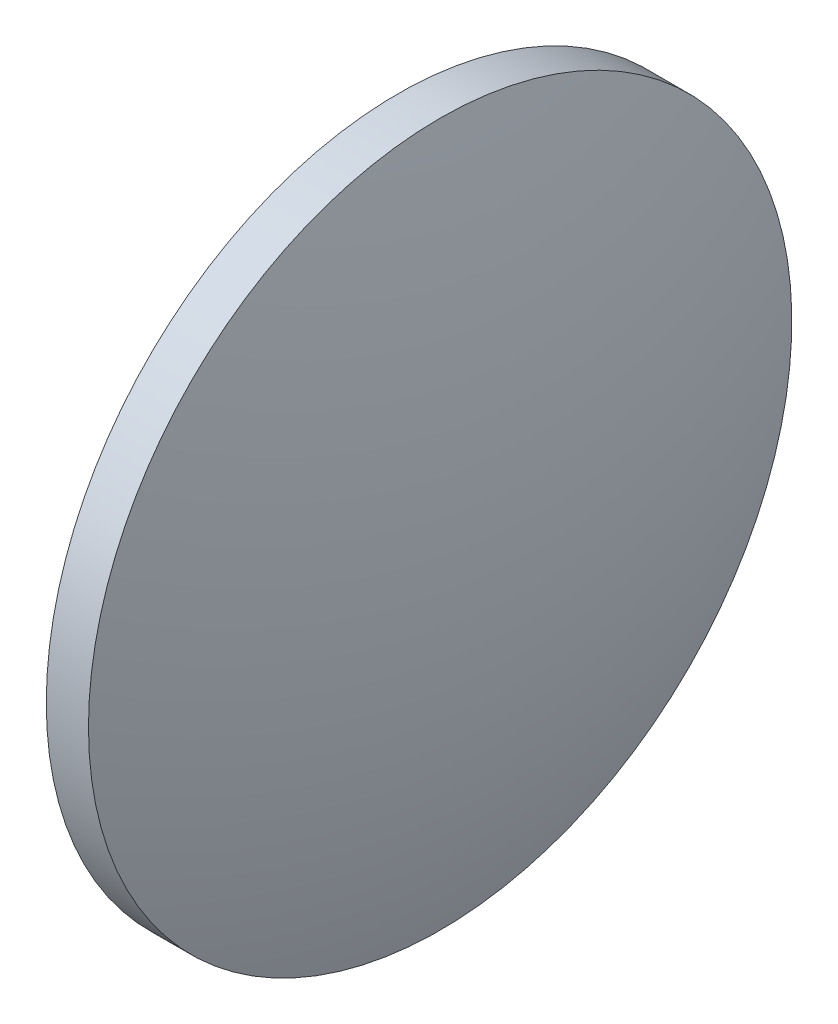
ISO-10303-21;
HEADER;
FILE_DESCRIPTION(('STEP AP214'),'2;1');
FILE_NAME('part.step','',(''),(''),'','','');
FILE_SCHEMA(('AUTOMOTIVE_DESIGN { 1 0 10303 214 1 1 1 1 }'));
ENDSEC;
DATA;
#1=APPLICATION_CONTEXT('core data for automotive mechanical design processes');
#2=APPLICATION_PROTOCOL_DEFINITION('international standard','automotive_design',2000,#1);
#3=PRODUCT_CONTEXT('',#1,'mechanical');
#4=PRODUCT('Part','Part','',(#3));
#5=PRODUCT_RELATED_PRODUCT_CATEGORY('part','',(#4));
#6=PRODUCT_DEFINITION_FORMATION('','',#4);
#7=PRODUCT_DEFINITION_CONTEXT('part definition',#1,'design');
#8=PRODUCT_DEFINITION('design','',#6,#7);
#9=PRODUCT_DEFINITION_SHAPE('','',#8);
#10=(LENGTH_UNIT() NAMED_UNIT(*) SI_UNIT(.MILLI.,.METRE.));
#11=(NAMED_UNIT(*) PLANE_ANGLE_UNIT() SI_UNIT($,.RADIAN.));
#12=(NAMED_UNIT(*) SI_UNIT($,.STERADIAN.) SOLID_ANGLE_UNIT());
#13=UNCERTAINTY_MEASURE_WITH_UNIT(LENGTH_MEASURE(1.E-05),#10,'distance_accuracy_value','');
#14=(GEOMETRIC_REPRESENTATION_CONTEXT(3) GLOBAL_UNCERTAINTY_ASSIGNED_CONTEXT((#13)) GLOBAL_UNIT_ASSIGNED_CONTEXT((#10,
#11,#12)) REPRESENTATION_CONTEXT('',''));
#15=CARTESIAN_POINT('',(0.,0.,0.));
#16=DIRECTION('',(0.,0.,1.));
#17=DIRECTION('',(1.,0.,0.));
#18=AXIS2_PLACEMENT_3D('',#15,#16,#17);
#19=CARTESIAN_POINT('',(415.943717329495,116.237463983383,0.));
#20=DIRECTION('',(-1.,0.,0.));
#21=DIRECTION('',(0.,1.,0.));
#22=AXIS2_PLACEMENT_3D('',#19,#20,#21);
#23=SPHERICAL_SURFACE('',#22,82.6843540051678);
#24=CARTESIAN_POINT('',(494.758071334662,116.237463983383,0.));
#25=DIRECTION('',(-1.,0.,0.));
#26=DIRECTION('',(0.,0.,1.));
#27=AXIS2_PLACEMENT_3D('',#24,#25,#26);
#28=CIRCLE('',#27,25.);
#29=CARTESIAN_POINT('',(494.758071334662,116.237463983383,25.));
#30=VERTEX_POINT('',#29);
#31=EDGE_CURVE('E10',#30,#30,#28,.T.);
#32=ORIENTED_EDGE('',*,*,#31,.F.);
#33=EDGE_LOOP('',(#32));
#34=FACE_BOUND('',#33,.T.);
#35=ADVANCED_FACE('F35',(#34),#23,.T.);
#36=CARTESIAN_POINT('',(487.786296045546,116.237463983383,0.));
#37=DIRECTION('',(-1.,0.,0.));
#38=DIRECTION('',(0.,0.,1.));
#39=AXIS2_PLACEMENT_3D('',#36,#37,#38);
#40=CYLINDRICAL_SURFACE('',#39,25.);
#41=CARTESIAN_POINT('',(491.758071334662,116.237463983383,0.));
#42=DIRECTION('',(-1.,0.,0.));
#43=DIRECTION('',(0.,0.,1.));
#44=AXIS2_PLACEMENT_3D('',#41,#42,#43);
#45=CIRCLE('',#44,25.);
#46=CARTESIAN_POINT('',(491.758071334662,116.237463983383,25.));
#47=VERTEX_POINT('',#46);
#48=EDGE_CURVE('E41',#47,#47,#45,.T.);
#49=ORIENTED_EDGE('',*,*,#48,.F.);
#50=EDGE_LOOP('',(#49));
#51=FACE_BOUND('',#50,.T.);
#52=ORIENTED_EDGE('',*,*,#31,.T.);
#53=EDGE_LOOP('',(#52));
#54=FACE_BOUND('',#53,.T.);
#55=ADVANCED_FACE('F49',(#51,#54),#40,.T.);
#56=CARTESIAN_POINT('',(491.758071334662,116.237463983383,0.));
#57=DIRECTION('',(1.,0.,0.));
#58=DIRECTION('',(0.,0.,-1.));
#59=AXIS2_PLACEMENT_3D('',#56,#57,#58);
#60=PLANE('',#59);
#61=ORIENTED_EDGE('',*,*,#48,.T.);
#62=EDGE_LOOP('',(#61));
#63=FACE_BOUND('',#62,.T.);
#64=ADVANCED_FACE('F47',(#63),#60,.F.);
#65=CLOSED_SHELL('',(#35,#55,#64));
#66=MANIFOLD_SOLID_BREP('B2',#65);
#67=ADVANCED_BREP_SHAPE_REPRESENTATION('',(#18,#66),#14);
#68=SHAPE_DEFINITION_REPRESENTATION(#9,#67);
ENDSEC;
END-ISO-10303-21;
